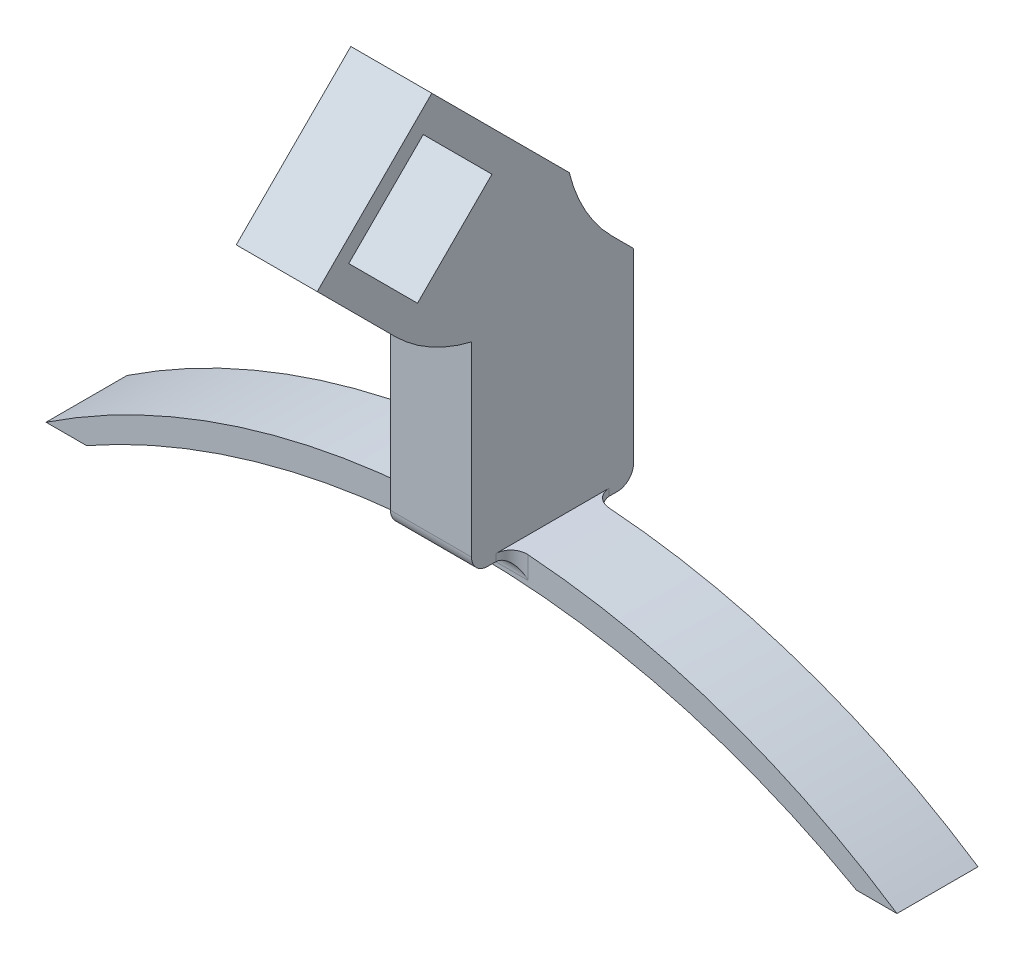
ISO-10303-21;
HEADER;
FILE_DESCRIPTION(('STEP AP214'),'2;1');
FILE_NAME('part.step','',(''),(''),'','','');
FILE_SCHEMA(('AUTOMOTIVE_DESIGN { 1 0 10303 214 1 1 1 1 }'));
ENDSEC;
DATA;
#1=APPLICATION_CONTEXT('core data for automotive mechanical design processes');
#2=APPLICATION_PROTOCOL_DEFINITION('international standard','automotive_design',2000,#1);
#3=PRODUCT_CONTEXT('',#1,'mechanical');
#4=PRODUCT('Part','Part','',(#3));
#5=PRODUCT_RELATED_PRODUCT_CATEGORY('part','',(#4));
#6=PRODUCT_DEFINITION_FORMATION('','',#4);
#7=PRODUCT_DEFINITION_CONTEXT('part definition',#1,'design');
#8=PRODUCT_DEFINITION('design','',#6,#7);
#9=PRODUCT_DEFINITION_SHAPE('','',#8);
#10=(LENGTH_UNIT() NAMED_UNIT(*) SI_UNIT(.MILLI.,.METRE.));
#11=(NAMED_UNIT(*) PLANE_ANGLE_UNIT() SI_UNIT($,.RADIAN.));
#12=(NAMED_UNIT(*) SI_UNIT($,.STERADIAN.) SOLID_ANGLE_UNIT());
#13=UNCERTAINTY_MEASURE_WITH_UNIT(LENGTH_MEASURE(1.E-05),#10,'distance_accuracy_value','');
#14=(GEOMETRIC_REPRESENTATION_CONTEXT(3) GLOBAL_UNCERTAINTY_ASSIGNED_CONTEXT((#13)) GLOBAL_UNIT_ASSIGNED_CONTEXT((#10,
#11,#12)) REPRESENTATION_CONTEXT('',''));
#15=CARTESIAN_POINT('',(0.,0.,0.));
#16=DIRECTION('',(0.,0.,1.));
#17=DIRECTION('',(1.,0.,0.));
#18=AXIS2_PLACEMENT_3D('',#15,#16,#17);
#19=CARTESIAN_POINT('',(52.5285613540198,-34.7033219348849,7.5));
#20=DIRECTION('',(0.,0.,-1.));
#21=DIRECTION('',(-1.,0.,0.));
#22=AXIS2_PLACEMENT_3D('',#19,#20,#21);
#23=CYLINDRICAL_SURFACE('',#22,47.4894594322548);
#24=DIRECTION('',(0.,0.,-1.));
#25=VECTOR('',#24,1.);
#26=CARTESIAN_POINT('',(50.0285613540198,12.7202877671167,7.5));
#27=LINE('',#26,#25);
#28=CARTESIAN_POINT('',(50.0285613540198,12.7202877671167,1.5));
#29=VERTEX_POINT('',#28);
#30=CARTESIAN_POINT('',(50.0285613540198,12.7202877671167,8.5));
#31=VERTEX_POINT('',#30);
#32=EDGE_CURVE('E355',#29,#31,#27,.F.);
#33=ORIENTED_EDGE('',*,*,#32,.F.);
#34=CARTESIAN_POINT('',(50.0285613540198,12.7202877671167,1.5));
#35=CARTESIAN_POINT('',(50.0285611870085,12.7202876143016,1.5281028969218));
#36=CARTESIAN_POINT('',(50.027375949356,12.7202252930694,1.55619232424922));
#37=CARTESIAN_POINT('',(50.0226476887969,12.7199757376473,1.61217003102266));
#38=CARTESIAN_POINT('',(50.0191047831366,12.7197885096689,1.64005832040151));
#39=CARTESIAN_POINT('',(50.0049737469269,12.7190394313109,1.72307141389749));
#40=CARTESIAN_POINT('',(49.9908832008338,12.7182901891765,1.77763992577612));
#41=CARTESIAN_POINT('',(49.953756408002,12.7162887570188,1.88363154197802));
#42=CARTESIAN_POINT('',(49.9307159429681,12.7150363298236,1.93505314984708));
#43=CARTESIAN_POINT('',(49.8763508538252,12.7120265805486,2.03329373375107));
#44=CARTESIAN_POINT('',(49.8450276293138,12.7102693437658,2.08011348556314));
#45=CARTESIAN_POINT('',(49.7749761442007,12.7062525549617,2.16784595949825));
#46=CARTESIAN_POINT('',(49.7362446344536,12.703992782466,2.20875607588789));
#47=CARTESIAN_POINT('',(49.6524815534041,12.6989847453834,2.28350133233952));
#48=CARTESIAN_POINT('',(49.6074487674595,12.6962363865883,2.31733510521193));
#49=CARTESIAN_POINT('',(49.5123057312809,12.6902771307497,2.37701246497592));
#50=CARTESIAN_POINT('',(49.462187881212,12.6870655382727,2.4028438513297));
#51=CARTESIAN_POINT('',(49.3583629745673,12.6802332144889,2.44571706659243));
#52=CARTESIAN_POINT('',(49.3046578903845,12.676612707274,2.46276368147772));
#53=CARTESIAN_POINT('',(49.2136236116243,12.6703128597763,2.48343392968768));
#54=CARTESIAN_POINT('',(49.1768539704628,12.6677259345879,2.48964306664276));
#55=CARTESIAN_POINT('',(49.1029138539176,12.6624366090674,2.49792558620556));
#56=CARTESIAN_POINT('',(49.0657440302243,12.6597343799575,2.50000489714784));
#57=CARTESIAN_POINT('',(49.0285613540198,12.6569858889435,2.5));
#58=B_SPLINE_CURVE_WITH_KNOTS('',3,(#34,#35,#36,#37,#38,#39,#40,#41,#42,#43,#44,#45,#46,#47,#48,
#49,#50,#51,#52,#53,#54,#55,#56,#57),.UNSPECIFIED.,.F.,.F.,(4,2,2,2,2,2,2,2,2,2,2,4),(0.,
0.0842568840678303,0.168509578373974,0.336732167263269,0.505034139578706,0.673307690846444,
0.841655213903606,1.01003523266943,1.17867071647206,1.3472142296471,1.45913769869857,
1.57090038598479),.UNSPECIFIED.);
#59=CARTESIAN_POINT('',(49.0285613540198,12.6569858889435,2.5));
#60=VERTEX_POINT('',#59);
#61=EDGE_CURVE('E52',#29,#60,#58,.T.);
#62=ORIENTED_EDGE('',*,*,#61,.T.);
#63=CARTESIAN_POINT('',(52.5285613540198,-34.7033219348849,2.5));
#64=DIRECTION('',(0.,0.,1.));
#65=DIRECTION('',(-1.,0.,0.));
#66=AXIS2_PLACEMENT_3D('',#63,#64,#65);
#67=CIRCLE('',#66,47.4894594322548);
#68=CARTESIAN_POINT('',(26.2642806770099,4.86227319127271,2.5));
#69=VERTEX_POINT('',#68);
#70=EDGE_CURVE('E358',#60,#69,#67,.T.);
#71=ORIENTED_EDGE('',*,*,#70,.T.);
#72=DIRECTION('',(0.,0.,-1.));
#73=VECTOR('',#72,1.);
#74=CARTESIAN_POINT('',(26.2642806770099,4.86227319127271,7.5));
#75=LINE('',#74,#73);
#76=CARTESIAN_POINT('',(26.2642806770099,4.86227319127271,7.5));
#77=VERTEX_POINT('',#76);
#78=EDGE_CURVE('E398',#77,#69,#75,.T.);
#79=ORIENTED_EDGE('',*,*,#78,.F.);
#80=CARTESIAN_POINT('',(52.5285613540198,-34.7033219348849,7.5));
#81=DIRECTION('',(0.,0.,1.));
#82=DIRECTION('',(-1.,0.,0.));
#83=AXIS2_PLACEMENT_3D('',#80,#81,#82);
#84=CIRCLE('',#83,47.4894594322548);
#85=CARTESIAN_POINT('',(49.0285613540198,12.6569858889435,7.5));
#86=VERTEX_POINT('',#85);
#87=EDGE_CURVE('E364',#86,#77,#84,.T.);
#88=ORIENTED_EDGE('',*,*,#87,.F.);
#89=CARTESIAN_POINT('',(49.0285613540198,12.6569858889435,7.5));
#90=CARTESIAN_POINT('',(49.0567202498051,12.659067015759,7.50000022499935));
#91=CARTESIAN_POINT('',(49.0848676233445,12.661121726342,7.50119013401365));
#92=CARTESIAN_POINT('',(49.1409654302538,12.6651669581399,7.50593836505136));
#93=CARTESIAN_POINT('',(49.1689158708592,12.6671574817227,7.50949659959752));
#94=CARTESIAN_POINT('',(49.2521274047336,12.6730098689455,7.52369270268104));
#95=CARTESIAN_POINT('',(49.3068377033602,12.6767591166834,7.53785205098455));
#96=CARTESIAN_POINT('',(49.4131223690788,12.6838666714362,7.57518037273886));
#97=CARTESIAN_POINT('',(49.4646950460863,12.6872247686325,7.59835415299989));
#98=CARTESIAN_POINT('',(49.5632242368278,12.6934919892054,7.65305955768381));
#99=CARTESIAN_POINT('',(49.6101817105833,12.696401206027,7.68458943886511));
#100=CARTESIAN_POINT('',(49.6980629456667,12.7017302775936,7.75505999913046));
#101=CARTESIAN_POINT('',(49.7389964339797,12.70415092364,7.79398849338239));
#102=CARTESIAN_POINT('',(49.8137570856107,12.7084909479955,7.87819808773634));
#103=CARTESIAN_POINT('',(49.8475828592652,12.7104102282981,7.92348042722829));
#104=CARTESIAN_POINT('',(49.9070927232626,12.7137377532242,8.01901579378939));
#105=CARTESIAN_POINT('',(49.9327904944188,12.7151468571464,8.06926027958997));
#106=CARTESIAN_POINT('',(49.9753753723525,12.7174589125023,8.17334997303155));
#107=CARTESIAN_POINT('',(49.992267822675,12.7183621709353,8.22719297446141));
#108=CARTESIAN_POINT('',(50.0125093649755,12.7194395112318,8.31781146466466));
#109=CARTESIAN_POINT('',(50.0185252639185,12.7197579280393,8.35401197423569));
#110=CARTESIAN_POINT('',(50.0265506670198,12.7201817773474,8.42680321401513));
#111=CARTESIAN_POINT('',(50.0285658755739,12.7202875131029,8.46339331372184));
#112=CARTESIAN_POINT('',(50.0285613540198,12.7202877671167,8.5));
#113=B_SPLINE_CURVE_WITH_KNOTS('',3,(#89,#90,#91,#92,#93,#94,#95,#96,#97,#98,#99,#100,#101,#102,
#103,#104,#105,#106,#107,#108,#109,#110,#111,#112),.UNSPECIFIED.,.F.,.F.,(4,2,2,2,2,2,2,2,2,2,2,
4),(0.,0.0846552642189612,0.169307401756448,0.338347371899864,0.507477603899872,
0.676572579853326,0.845391448044261,1.01424329217599,1.18280939852037,1.35127309038726,
1.46116205514336,1.57089422154783),.UNSPECIFIED.);
#114=EDGE_CURVE('E486',#86,#31,#113,.T.);
#115=ORIENTED_EDGE('',*,*,#114,.T.);
#116=EDGE_LOOP('',(#33,#62,#71,#79,#88,#115));
#117=FACE_BOUND('',#116,.T.);
#118=ADVANCED_FACE('F41',(#117),#23,.T.);
#119=DIRECTION('',(0.,0.,-1.));
#120=VECTOR('',#119,1.);
#121=CARTESIAN_POINT('',(55.0285613540198,12.7202877671167,7.5));
#122=LINE('',#121,#120);
#123=CARTESIAN_POINT('',(55.0285613540198,12.7202877671167,8.5));
#124=VERTEX_POINT('',#123);
#125=CARTESIAN_POINT('',(55.0285613540198,12.7202877671167,1.5));
#126=VERTEX_POINT('',#125);
#127=EDGE_CURVE('E352',#124,#126,#122,.T.);
#128=ORIENTED_EDGE('',*,*,#127,.F.);
#129=CARTESIAN_POINT('',(55.0285613540198,12.7202877671167,8.5));
#130=CARTESIAN_POINT('',(55.0285615210311,12.7202876143016,8.4718971030782));
#131=CARTESIAN_POINT('',(55.0297467586836,12.7202252930694,8.44380767575078));
#132=CARTESIAN_POINT('',(55.0344750192426,12.7199757376473,8.38782996897734));
#133=CARTESIAN_POINT('',(55.0380179249029,12.7197885096689,8.35994167959849));
#134=CARTESIAN_POINT('',(55.0521489611127,12.7190394313109,8.27692858610251));
#135=CARTESIAN_POINT('',(55.0662395072057,12.7182901891765,8.22236007422388));
#136=CARTESIAN_POINT('',(55.1033663000376,12.7162887570188,8.11636845802198));
#137=CARTESIAN_POINT('',(55.1264067650715,12.7150363298236,8.06494685015292));
#138=CARTESIAN_POINT('',(55.1807718542144,12.7120265805486,7.96670626624893));
#139=CARTESIAN_POINT('',(55.2120950787257,12.7102693437658,7.91988651443686));
#140=CARTESIAN_POINT('',(55.2821465638388,12.7062525549617,7.83215404050175));
#141=CARTESIAN_POINT('',(55.320878073586,12.703992782466,7.79124392411211));
#142=CARTESIAN_POINT('',(55.4046411546354,12.6989847453834,7.71649866766047));
#143=CARTESIAN_POINT('',(55.4496739405801,12.6962363865883,7.68266489478807));
#144=CARTESIAN_POINT('',(55.5448169767587,12.6902771307497,7.62298753502409));
#145=CARTESIAN_POINT('',(55.5949348268276,12.6870655382727,7.5971561486703));
#146=CARTESIAN_POINT('',(55.6987597334723,12.6802332144889,7.55428293340757));
#147=CARTESIAN_POINT('',(55.7524648176551,12.676612707274,7.53723631852228));
#148=CARTESIAN_POINT('',(55.8434990964153,12.6703128597763,7.51656607031232));
#149=CARTESIAN_POINT('',(55.8802687375767,12.6677259345879,7.51035693335724));
#150=CARTESIAN_POINT('',(55.954208854122,12.6624366090674,7.50207441379444));
#151=CARTESIAN_POINT('',(55.9913786778153,12.6597343799575,7.49999510285216));
#152=CARTESIAN_POINT('',(56.0285613540198,12.6569858889435,7.5));
#153=B_SPLINE_CURVE_WITH_KNOTS('',3,(#129,#130,#131,#132,#133,#134,#135,#136,#137,#138,#139,
#140,#141,#142,#143,#144,#145,#146,#147,#148,#149,#150,#151,#152),.UNSPECIFIED.,.F.,.F.,(4,2,2,
2,2,2,2,2,2,2,2,4),(0.,0.0842568840678318,0.168509578373973,0.336732167263268,0.50503413957871,
0.673307690846443,0.841655213903608,1.01003523266943,1.17867071647206,1.3472142296471,
1.45913769869856,1.57090038598479),.UNSPECIFIED.);
#154=CARTESIAN_POINT('',(56.0285613540198,12.6569858889435,7.5));
#155=VERTEX_POINT('',#154);
#156=EDGE_CURVE('E496',#124,#155,#153,.T.);
#157=ORIENTED_EDGE('',*,*,#156,.T.);
#158=CARTESIAN_POINT('',(78.7928420310297,4.86227319127271,7.5));
#159=VERTEX_POINT('',#158);
#160=EDGE_CURVE('E359',#159,#155,#84,.T.);
#161=ORIENTED_EDGE('',*,*,#160,.F.);
#162=DIRECTION('',(0.,0.,-1.));
#163=VECTOR('',#162,1.);
#164=CARTESIAN_POINT('',(78.7928420310297,4.86227319127271,7.5));
#165=LINE('',#164,#163);
#166=CARTESIAN_POINT('',(78.7928420310297,4.86227319127271,2.5));
#167=VERTEX_POINT('',#166);
#168=EDGE_CURVE('E373',#159,#167,#165,.T.);
#169=ORIENTED_EDGE('',*,*,#168,.T.);
#170=CARTESIAN_POINT('',(56.0285613540198,12.6569858889435,2.5));
#171=VERTEX_POINT('',#170);
#172=EDGE_CURVE('E374',#167,#171,#67,.T.);
#173=ORIENTED_EDGE('',*,*,#172,.T.);
#174=CARTESIAN_POINT('',(56.0285613540198,12.6569858889435,2.5));
#175=CARTESIAN_POINT('',(56.0004024582345,12.659067015759,2.49999977500065));
#176=CARTESIAN_POINT('',(55.9722550846951,12.661121726342,2.49880986598635));
#177=CARTESIAN_POINT('',(55.9161572777858,12.6651669581399,2.49406163494864));
#178=CARTESIAN_POINT('',(55.8882068371804,12.6671574817227,2.49050340040248));
#179=CARTESIAN_POINT('',(55.8049953033059,12.6730098689455,2.47630729731897));
#180=CARTESIAN_POINT('',(55.7502850046794,12.6767591166834,2.46214794901546));
#181=CARTESIAN_POINT('',(55.6440003389607,12.6838666714362,2.42481962726114));
#182=CARTESIAN_POINT('',(55.5924276619533,12.6872247686325,2.40164584700011));
#183=CARTESIAN_POINT('',(55.4938984712118,12.6934919892054,2.34694044231619));
#184=CARTESIAN_POINT('',(55.4469409974562,12.696401206027,2.31541056113489));
#185=CARTESIAN_POINT('',(55.3590597623729,12.7017302775936,2.24494000086954));
#186=CARTESIAN_POINT('',(55.3181262740599,12.70415092364,2.20601150661761));
#187=CARTESIAN_POINT('',(55.2433656224288,12.7084909479955,2.12180191226366));
#188=CARTESIAN_POINT('',(55.2095398487743,12.7104102282981,2.07651957277171));
#189=CARTESIAN_POINT('',(55.150029984777,12.7137377532242,1.98098420621061));
#190=CARTESIAN_POINT('',(55.1243322136208,12.7151468571464,1.93073972041003));
#191=CARTESIAN_POINT('',(55.0817473356871,12.7174589125023,1.82665002696845));
#192=CARTESIAN_POINT('',(55.0648548853646,12.7183621709353,1.77280702553859));
#193=CARTESIAN_POINT('',(55.0446133430641,12.7194395112318,1.68218853533534));
#194=CARTESIAN_POINT('',(55.0385974441211,12.7197579280393,1.64598802576431));
#195=CARTESIAN_POINT('',(55.0305720410198,12.7201817773474,1.57319678598487));
#196=CARTESIAN_POINT('',(55.0285568324657,12.7202875131029,1.53660668627816));
#197=CARTESIAN_POINT('',(55.0285613540198,12.7202877671167,1.5));
#198=B_SPLINE_CURVE_WITH_KNOTS('',3,(#174,#175,#176,#177,#178,#179,#180,#181,#182,#183,#184,
#185,#186,#187,#188,#189,#190,#191,#192,#193,#194,#195,#196,#197),.UNSPECIFIED.,.F.,.F.,(4,2,2,
2,2,2,2,2,2,2,2,4),(0.,0.084655264218954,0.169307401756441,0.338347371899864,0.507477603899872,
0.676572579853326,0.845391448044258,1.01424329217599,1.18280939852037,1.35127309038726,
1.46116205514337,1.57089422154783),.UNSPECIFIED.);
#199=EDGE_CURVE('E11',#171,#126,#198,.T.);
#200=ORIENTED_EDGE('',*,*,#199,.T.);
#201=EDGE_LOOP('',(#128,#157,#161,#169,#173,#200));
#202=FACE_BOUND('',#201,.T.);
#203=ADVANCED_FACE('F556',(#202),#23,.T.);
#204=CARTESIAN_POINT('',(52.5285613540198,-34.7033219348849,7.5));
#205=DIRECTION('',(0.,0.,-1.));
#206=DIRECTION('',(-1.,0.,0.));
#207=AXIS2_PLACEMENT_3D('',#204,#205,#206);
#208=PLANE('',#207);
#209=DIRECTION('',(-1.,0.,0.));
#210=VECTOR('',#209,1.);
#211=CARTESIAN_POINT('',(52.5285613540198,11.28613749737,7.5));
#212=LINE('',#211,#210);
#213=CARTESIAN_POINT('',(56.0285613540198,11.28613749737,7.5));
#214=VERTEX_POINT('',#213);
#215=CARTESIAN_POINT('',(49.0285613540198,11.28613749737,7.5));
#216=VERTEX_POINT('',#215);
#217=EDGE_CURVE('E469',#214,#216,#212,.T.);
#218=ORIENTED_EDGE('',*,*,#217,.T.);
#219=DIRECTION('',(0.,-1.,0.));
#220=VECTOR('',#219,1.);
#221=CARTESIAN_POINT('',(49.0285613540198,12.7202877671167,7.5));
#222=LINE('',#221,#220);
#223=EDGE_CURVE('E475',#216,#86,#222,.F.);
#224=ORIENTED_EDGE('',*,*,#223,.T.);
#225=ORIENTED_EDGE('',*,*,#87,.T.);
#226=DIRECTION('',(1.,0.,0.));
#227=VECTOR('',#226,1.);
#228=CARTESIAN_POINT('',(26.2642806770099,4.86227319127271,7.5));
#229=LINE('',#228,#227);
#230=CARTESIAN_POINT('',(28.7642806770099,4.86227319127271,7.5));
#231=VERTEX_POINT('',#230);
#232=EDGE_CURVE('E363',#77,#231,#229,.T.);
#233=ORIENTED_EDGE('',*,*,#232,.T.);
#234=CARTESIAN_POINT('',(52.5285613540198,-37.3721684334914,7.5));
#235=DIRECTION('',(0.,0.,-1.));
#236=DIRECTION('',(-1.,0.,0.));
#237=AXIS2_PLACEMENT_3D('',#234,#235,#236);
#238=CIRCLE('',#237,48.4612122779786);
#239=CARTESIAN_POINT('',(76.2928420310297,4.8622731912727,7.5));
#240=VERTEX_POINT('',#239);
#241=EDGE_CURVE('E367',#231,#240,#238,.T.);
#242=ORIENTED_EDGE('',*,*,#241,.T.);
#243=DIRECTION('',(1.,0.,0.));
#244=VECTOR('',#243,1.);
#245=CARTESIAN_POINT('',(78.7928420310297,4.86227319127271,7.5));
#246=LINE('',#245,#244);
#247=EDGE_CURVE('E370',#240,#159,#246,.T.);
#248=ORIENTED_EDGE('',*,*,#247,.T.);
#249=ORIENTED_EDGE('',*,*,#160,.T.);
#250=DIRECTION('',(0.,1.,0.));
#251=VECTOR('',#250,1.);
#252=CARTESIAN_POINT('',(56.0285613540198,12.28613749737,7.5));
#253=LINE('',#252,#251);
#254=EDGE_CURVE('E472',#155,#214,#253,.F.);
#255=ORIENTED_EDGE('',*,*,#254,.T.);
#256=EDGE_LOOP('',(#218,#224,#225,#233,#242,#248,#249,#255));
#257=FACE_BOUND('',#256,.T.);
#258=ADVANCED_FACE('F644',(#257),#208,.F.);
#259=CARTESIAN_POINT('',(52.5285613540198,-34.7033219348849,2.5));
#260=DIRECTION('',(0.,0.,-1.));
#261=DIRECTION('',(-1.,0.,0.));
#262=AXIS2_PLACEMENT_3D('',#259,#260,#261);
#263=PLANE('',#262);
#264=ORIENTED_EDGE('',*,*,#70,.F.);
#265=DIRECTION('',(0.,-1.,0.));
#266=VECTOR('',#265,1.);
#267=CARTESIAN_POINT('',(49.0285613540198,-34.7033219348849,2.5));
#268=LINE('',#267,#266);
#269=CARTESIAN_POINT('',(49.0285613540198,11.28613749737,2.5));
#270=VERTEX_POINT('',#269);
#271=EDGE_CURVE('E483',#60,#270,#268,.T.);
#272=ORIENTED_EDGE('',*,*,#271,.T.);
#273=DIRECTION('',(-1.,0.,0.));
#274=VECTOR('',#273,1.);
#275=CARTESIAN_POINT('',(55.0285613540198,11.28613749737,2.5));
#276=LINE('',#275,#274);
#277=CARTESIAN_POINT('',(56.0285613540198,11.28613749737,2.5));
#278=VERTEX_POINT('',#277);
#279=EDGE_CURVE('E60',#270,#278,#276,.F.);
#280=ORIENTED_EDGE('',*,*,#279,.T.);
#281=DIRECTION('',(0.,1.,0.));
#282=VECTOR('',#281,1.);
#283=CARTESIAN_POINT('',(56.0285613540198,-34.7033219348849,2.5));
#284=LINE('',#283,#282);
#285=EDGE_CURVE('E480',#278,#171,#284,.T.);
#286=ORIENTED_EDGE('',*,*,#285,.T.);
#287=ORIENTED_EDGE('',*,*,#172,.F.);
#288=DIRECTION('',(1.,0.,0.));
#289=VECTOR('',#288,1.);
#290=CARTESIAN_POINT('',(78.7928420310297,4.86227319127271,2.5));
#291=LINE('',#290,#289);
#292=CARTESIAN_POINT('',(76.2928420310297,4.8622731912727,2.5));
#293=VERTEX_POINT('',#292);
#294=EDGE_CURVE('E384',#293,#167,#291,.T.);
#295=ORIENTED_EDGE('',*,*,#294,.F.);
#296=CARTESIAN_POINT('',(52.5285613540198,-37.3721684334914,2.5));
#297=DIRECTION('',(0.,0.,-1.));
#298=DIRECTION('',(-1.,0.,0.));
#299=AXIS2_PLACEMENT_3D('',#296,#297,#298);
#300=CIRCLE('',#299,48.4612122779786);
#301=CARTESIAN_POINT('',(28.7642806770099,4.86227319127271,2.5));
#302=VERTEX_POINT('',#301);
#303=EDGE_CURVE('E381',#302,#293,#300,.T.);
#304=ORIENTED_EDGE('',*,*,#303,.F.);
#305=DIRECTION('',(1.,0.,0.));
#306=VECTOR('',#305,1.);
#307=CARTESIAN_POINT('',(26.2642806770099,4.86227319127271,2.5));
#308=LINE('',#307,#306);
#309=EDGE_CURVE('E378',#69,#302,#308,.T.);
#310=ORIENTED_EDGE('',*,*,#309,.F.);
#311=EDGE_LOOP('',(#264,#272,#280,#286,#287,#295,#304,#310));
#312=FACE_BOUND('',#311,.T.);
#313=ADVANCED_FACE('F553',(#312),#263,.T.);
#314=CARTESIAN_POINT('',(26.2642806770099,4.86227319127271,7.5));
#315=DIRECTION('',(0.,1.,0.));
#316=DIRECTION('',(0.,0.,1.));
#317=AXIS2_PLACEMENT_3D('',#314,#315,#316);
#318=PLANE('',#317);
#319=ORIENTED_EDGE('',*,*,#309,.T.);
#320=DIRECTION('',(0.,0.,-1.));
#321=VECTOR('',#320,1.);
#322=CARTESIAN_POINT('',(28.7642806770099,4.86227319127271,7.5));
#323=LINE('',#322,#321);
#324=EDGE_CURVE('E394',#231,#302,#323,.T.);
#325=ORIENTED_EDGE('',*,*,#324,.F.);
#326=ORIENTED_EDGE('',*,*,#232,.F.);
#327=ORIENTED_EDGE('',*,*,#78,.T.);
#328=EDGE_LOOP('',(#319,#325,#326,#327));
#329=FACE_BOUND('',#328,.T.);
#330=ADVANCED_FACE('F571',(#329),#318,.F.);
#331=CARTESIAN_POINT('',(52.5285613540198,-37.3721684334914,7.5));
#332=DIRECTION('',(0.,0.,-1.));
#333=DIRECTION('',(-1.,0.,0.));
#334=AXIS2_PLACEMENT_3D('',#331,#332,#333);
#335=CYLINDRICAL_SURFACE('',#334,48.4612122779786);
#336=ORIENTED_EDGE('',*,*,#303,.T.);
#337=DIRECTION('',(0.,0.,-1.));
#338=VECTOR('',#337,1.);
#339=CARTESIAN_POINT('',(76.2928420310297,4.8622731912727,7.5));
#340=LINE('',#339,#338);
#341=EDGE_CURVE('E390',#240,#293,#340,.T.);
#342=ORIENTED_EDGE('',*,*,#341,.F.);
#343=ORIENTED_EDGE('',*,*,#241,.F.);
#344=ORIENTED_EDGE('',*,*,#324,.T.);
#345=EDGE_LOOP('',(#336,#342,#343,#344));
#346=FACE_BOUND('',#345,.T.);
#347=ADVANCED_FACE('F566',(#346),#335,.F.);
#348=CARTESIAN_POINT('',(78.7928420310297,4.86227319127271,7.5));
#349=DIRECTION('',(0.,1.,0.));
#350=DIRECTION('',(-1.,0.,0.));
#351=AXIS2_PLACEMENT_3D('',#348,#349,#350);
#352=PLANE('',#351);
#353=ORIENTED_EDGE('',*,*,#294,.T.);
#354=ORIENTED_EDGE('',*,*,#168,.F.);
#355=ORIENTED_EDGE('',*,*,#247,.F.);
#356=ORIENTED_EDGE('',*,*,#341,.T.);
#357=EDGE_LOOP('',(#353,#354,#355,#356));
#358=FACE_BOUND('',#357,.T.);
#359=ADVANCED_FACE('F561',(#358),#352,.F.);
#360=CARTESIAN_POINT('',(50.0285613540198,12.28613749737,9.99999999999999));
#361=DIRECTION('',(1.,0.,0.));
#362=DIRECTION('',(0.,0.,-1.));
#363=AXIS2_PLACEMENT_3D('',#360,#361,#362);
#364=PLANE('',#363);
#365=DIRECTION('',(0.,-0.707106781186548,-0.707106781186548));
#366=VECTOR('',#365,1.);
#367=CARTESIAN_POINT('',(50.0285613540198,23.3342345362263,-1.04809703885629));
#368=LINE('',#367,#366);
#369=CARTESIAN_POINT('',(50.0285613540198,37.3624091292783,12.9800775541957));
#370=VERTEX_POINT('',#369);
#371=CARTESIAN_POINT('',(50.0285613540198,33.119768442159,8.73743686707646));
#372=VERTEX_POINT('',#371);
#373=EDGE_CURVE('E273',#370,#372,#368,.T.);
#374=ORIENTED_EDGE('',*,*,#373,.F.);
#375=DIRECTION('',(0.,-0.707106781186547,0.707106781186548));
#376=VECTOR('',#375,1.);
#377=CARTESIAN_POINT('',(50.0285613540198,26.314312090422,24.028174593052));
#378=LINE('',#377,#376);
#379=CARTESIAN_POINT('',(50.0285613540198,32.7662150515657,17.5762716319083));
#380=VERTEX_POINT('',#379);
#381=EDGE_CURVE('E276',#370,#380,#378,.T.);
#382=ORIENTED_EDGE('',*,*,#381,.T.);
#383=DIRECTION('',(0.,-0.707106781186548,-0.707106781186548));
#384=VECTOR('',#383,1.);
#385=CARTESIAN_POINT('',(50.0285613540198,18.7380404585137,3.54809703885627));
#386=LINE('',#385,#384);
#387=CARTESIAN_POINT('',(50.0285613540198,28.5235743644465,13.333630944789));
#388=VERTEX_POINT('',#387);
#389=EDGE_CURVE('E264',#380,#388,#386,.T.);
#390=ORIENTED_EDGE('',*,*,#389,.T.);
#391=DIRECTION('',(0.,-0.707106781186547,0.707106781186548));
#392=VECTOR('',#391,1.);
#393=CARTESIAN_POINT('',(50.0285613540198,22.0716714033027,19.7855339059327));
#394=LINE('',#393,#392);
#395=EDGE_CURVE('E234',#372,#388,#394,.T.);
#396=ORIENTED_EDGE('',*,*,#395,.F.);
#397=EDGE_LOOP('',(#374,#382,#390,#396));
#398=FACE_BOUND('',#397,.T.);
#399=DIRECTION('',(0.,1.,0.));
#400=VECTOR('',#399,1.);
#401=CARTESIAN_POINT('',(50.0285613540198,12.28613749737,0.));
#402=LINE('',#401,#400);
#403=CARTESIAN_POINT('',(50.0285613540198,13.28613749737,0.));
#404=VERTEX_POINT('',#403);
#405=CARTESIAN_POINT('',(50.0285613540198,24.78613749737,0.));
#406=VERTEX_POINT('',#405);
#407=EDGE_CURVE('E349',#404,#406,#402,.T.);
#408=ORIENTED_EDGE('',*,*,#407,.F.);
#409=CARTESIAN_POINT('',(50.0285613540198,13.28613749737,1.));
#410=DIRECTION('',(1.,0.,0.));
#411=DIRECTION('',(0.,0.,-1.));
#412=AXIS2_PLACEMENT_3D('',#409,#410,#411);
#413=CIRCLE('',#412,1.);
#414=CARTESIAN_POINT('',(50.0285613540198,12.28613749737,1.));
#415=VERTEX_POINT('',#414);
#416=EDGE_CURVE('E456',#404,#415,#413,.F.);
#417=ORIENTED_EDGE('',*,*,#416,.T.);
#418=DIRECTION('',(0.,0.,-1.));
#419=VECTOR('',#418,1.);
#420=CARTESIAN_POINT('',(50.0285613540198,12.28613749737,9.99999999999999));
#421=LINE('',#420,#419);
#422=CARTESIAN_POINT('',(50.0285613540198,12.28613749737,1.5));
#423=VERTEX_POINT('',#422);
#424=EDGE_CURVE('E330',#423,#415,#421,.T.);
#425=ORIENTED_EDGE('',*,*,#424,.F.);
#426=DIRECTION('',(0.,-1.,0.));
#427=VECTOR('',#426,1.);
#428=CARTESIAN_POINT('',(50.0285613540198,12.28613749737,1.5));
#429=LINE('',#428,#427);
#430=EDGE_CURVE('E445',#423,#29,#429,.F.);
#431=ORIENTED_EDGE('',*,*,#430,.T.);
#432=ORIENTED_EDGE('',*,*,#32,.T.);
#433=DIRECTION('',(0.,-1.,0.));
#434=VECTOR('',#433,1.);
#435=CARTESIAN_POINT('',(50.0285613540198,12.28613749737,8.5));
#436=LINE('',#435,#434);
#437=CARTESIAN_POINT('',(50.0285613540198,12.28613749737,8.5));
#438=VERTEX_POINT('',#437);
#439=EDGE_CURVE('E449',#31,#438,#436,.T.);
#440=ORIENTED_EDGE('',*,*,#439,.T.);
#441=CARTESIAN_POINT('',(50.0285613540198,12.28613749737,8.99999999999999));
#442=VERTEX_POINT('',#441);
#443=EDGE_CURVE('E331',#442,#438,#421,.T.);
#444=ORIENTED_EDGE('',*,*,#443,.F.);
#445=CARTESIAN_POINT('',(50.0285613540198,13.28613749737,8.99999999999999));
#446=DIRECTION('',(1.,0.,0.));
#447=DIRECTION('',(0.,0.,-1.));
#448=AXIS2_PLACEMENT_3D('',#445,#446,#447);
#449=CIRCLE('',#448,1.);
#450=CARTESIAN_POINT('',(50.0285613540198,13.28613749737,9.99999999999999));
#451=VERTEX_POINT('',#450);
#452=EDGE_CURVE('E453',#442,#451,#449,.F.);
#453=ORIENTED_EDGE('',*,*,#452,.T.);
#454=DIRECTION('',(0.,1.,0.));
#455=VECTOR('',#454,1.);
#456=CARTESIAN_POINT('',(50.0285613540198,12.28613749737,9.99999999999999));
#457=LINE('',#456,#455);
#458=CARTESIAN_POINT('',(50.0285613540198,24.78613749737,10.));
#459=VERTEX_POINT('',#458);
#460=EDGE_CURVE('E340',#451,#459,#457,.T.);
#461=ORIENTED_EDGE('',*,*,#460,.T.);
#462=CARTESIAN_POINT('',(50.0285613540198,34.5057357988225,7.64853048958703));
#463=DIRECTION('',(1.,0.,0.));
#464=DIRECTION('',(0.,0.,-1.));
#465=AXIS2_PLACEMENT_3D('',#462,#463,#464);
#466=CIRCLE('',#465,10.);
#467=CARTESIAN_POINT('',(50.0285613540198,27.434667986957,14.7195983014525));
#468=VERTEX_POINT('',#467);
#469=EDGE_CURVE('E410',#459,#468,#466,.F.);
#470=ORIENTED_EDGE('',*,*,#469,.T.);
#471=DIRECTION('',(0.,-0.707106781186546,-0.707106781186548));
#472=VECTOR('',#471,1.);
#473=CARTESIAN_POINT('',(50.0285613540198,32.2358849656758,19.5208152801713));
#474=LINE('',#473,#472);
#475=CARTESIAN_POINT('',(50.0285613540198,32.2358849656758,19.5208152801713));
#476=VERTEX_POINT('',#475);
#477=EDGE_CURVE('E302',#476,#468,#474,.T.);
#478=ORIENTED_EDGE('',*,*,#477,.F.);
#479=DIRECTION('',(0.,-0.707106781186549,0.707106781186546));
#480=VECTOR('',#479,1.);
#481=CARTESIAN_POINT('',(50.0285613540198,25.8783501229235,25.8783501229236));
#482=LINE('',#481,#480);
#483=CARTESIAN_POINT('',(50.0285613540198,39.3069527775413,12.4497474683059));
#484=VERTEX_POINT('',#483);
#485=EDGE_CURVE('E289',#484,#476,#482,.T.);
#486=ORIENTED_EDGE('',*,*,#485,.F.);
#487=DIRECTION('',(0.,-0.707106781186546,-0.707106781186548));
#488=VECTOR('',#487,1.);
#489=CARTESIAN_POINT('',(50.0285613540198,39.3069527775413,12.4497474683059));
#490=LINE('',#489,#488);
#491=CARTESIAN_POINT('',(50.0285613540198,30.8216714033027,3.96446609406727));
#492=VERTEX_POINT('',#491);
#493=EDGE_CURVE('E306',#484,#492,#490,.T.);
#494=ORIENTED_EDGE('',*,*,#493,.T.);
#495=CARTESIAN_POINT('',(50.0285613540198,33.1731409137157,-5.75513220738522));
#496=DIRECTION('',(1.,0.,0.));
#497=DIRECTION('',(0.,0.,-1.));
#498=AXIS2_PLACEMENT_3D('',#495,#496,#497);
#499=CIRCLE('',#498,10.);
#500=CARTESIAN_POINT('',(50.0285613540198,26.1020731018502,1.31593560448025));
#501=VERTEX_POINT('',#500);
#502=EDGE_CURVE('E416',#492,#501,#499,.T.);
#503=ORIENTED_EDGE('',*,*,#502,.T.);
#504=DIRECTION('',(0.,0.707106781186546,0.707106781186549));
#505=VECTOR('',#504,1.);
#506=CARTESIAN_POINT('',(50.0285613540198,19.8941482999688,-4.89198919740117));
#507=LINE('',#506,#505);
#508=EDGE_CURVE('E315',#406,#501,#507,.T.);
#509=ORIENTED_EDGE('',*,*,#508,.F.);
#510=EDGE_LOOP('',(#408,#417,#425,#431,#432,#440,#444,#453,#461,#470,#478,#486,#494,#503,#509));
#511=FACE_BOUND('',#510,.T.);
#512=ADVANCED_FACE('F641',(#398,#511),#364,.F.);
#513=CARTESIAN_POINT('',(55.0285613540198,12.28613749737,0.));
#514=DIRECTION('',(-1.,0.,0.));
#515=DIRECTION('',(0.,0.,1.));
#516=AXIS2_PLACEMENT_3D('',#513,#514,#515);
#517=PLANE('',#516);
#518=DIRECTION('',(0.,-0.707106781186548,-0.707106781186548));
#519=VECTOR('',#518,1.);
#520=CARTESIAN_POINT('',(55.0285613540198,7.59497170982872,-7.59497170982872));
#521=LINE('',#520,#519);
#522=CARTESIAN_POINT('',(55.0285613540198,32.7662150515657,17.5762716319083));
#523=VERTEX_POINT('',#522);
#524=CARTESIAN_POINT('',(55.0285613540198,28.5235743644465,13.333630944789));
#525=VERTEX_POINT('',#524);
#526=EDGE_CURVE('E243',#523,#525,#521,.T.);
#527=ORIENTED_EDGE('',*,*,#526,.F.);
#528=DIRECTION('',(0.,-0.707106781186547,0.707106781186548));
#529=VECTOR('',#528,1.);
#530=CARTESIAN_POINT('',(55.0285613540198,25.171243341737,25.171243341737));
#531=LINE('',#530,#529);
#532=CARTESIAN_POINT('',(55.0285613540198,37.3624091292783,12.9800775541957));
#533=VERTEX_POINT('',#532);
#534=EDGE_CURVE('E249',#533,#523,#531,.T.);
#535=ORIENTED_EDGE('',*,*,#534,.F.);
#536=DIRECTION('',(0.,-0.707106781186548,-0.707106781186548));
#537=VECTOR('',#536,1.);
#538=CARTESIAN_POINT('',(55.0285613540198,12.1911657875413,-12.1911657875413));
#539=LINE('',#538,#537);
#540=CARTESIAN_POINT('',(55.0285613540198,33.119768442159,8.73743686707646));
#541=VERTEX_POINT('',#540);
#542=EDGE_CURVE('E254',#533,#541,#539,.T.);
#543=ORIENTED_EDGE('',*,*,#542,.T.);
#544=DIRECTION('',(0.,-0.707106781186547,0.707106781186548));
#545=VECTOR('',#544,1.);
#546=CARTESIAN_POINT('',(55.0285613540198,20.9286026546177,20.9286026546177));
#547=LINE('',#546,#545);
#548=EDGE_CURVE('E231',#541,#525,#547,.T.);
#549=ORIENTED_EDGE('',*,*,#548,.T.);
#550=EDGE_LOOP('',(#527,#535,#543,#549));
#551=FACE_BOUND('',#550,.T.);
#552=DIRECTION('',(0.,0.,1.));
#553=VECTOR('',#552,1.);
#554=CARTESIAN_POINT('',(55.0285613540198,12.28613749737,0.));
#555=LINE('',#554,#553);
#556=CARTESIAN_POINT('',(55.0285613540198,12.28613749737,1.));
#557=VERTEX_POINT('',#556);
#558=CARTESIAN_POINT('',(55.0285613540198,12.28613749737,1.5));
#559=VERTEX_POINT('',#558);
#560=EDGE_CURVE('E339',#557,#559,#555,.T.);
#561=ORIENTED_EDGE('',*,*,#560,.F.);
#562=CARTESIAN_POINT('',(55.0285613540198,13.28613749737,1.));
#563=DIRECTION('',(-1.,0.,0.));
#564=DIRECTION('',(0.,0.,1.));
#565=AXIS2_PLACEMENT_3D('',#562,#563,#564);
#566=CIRCLE('',#565,1.);
#567=CARTESIAN_POINT('',(55.0285613540198,13.28613749737,0.));
#568=VERTEX_POINT('',#567);
#569=EDGE_CURVE('E439',#557,#568,#566,.F.);
#570=ORIENTED_EDGE('',*,*,#569,.T.);
#571=DIRECTION('',(0.,1.,0.));
#572=VECTOR('',#571,1.);
#573=CARTESIAN_POINT('',(55.0285613540198,12.28613749737,0.));
#574=LINE('',#573,#572);
#575=CARTESIAN_POINT('',(55.0285613540198,24.78613749737,0.));
#576=VERTEX_POINT('',#575);
#577=EDGE_CURVE('E346',#568,#576,#574,.T.);
#578=ORIENTED_EDGE('',*,*,#577,.T.);
#579=DIRECTION('',(0.,0.707106781186546,0.707106781186549));
#580=VECTOR('',#579,1.);
#581=CARTESIAN_POINT('',(55.0285613540198,19.8941482999688,-4.89198919740117));
#582=LINE('',#581,#580);
#583=CARTESIAN_POINT('',(55.0285613540198,26.1020731018502,1.31593560448025));
#584=VERTEX_POINT('',#583);
#585=EDGE_CURVE('E314',#576,#584,#582,.T.);
#586=ORIENTED_EDGE('',*,*,#585,.T.);
#587=CARTESIAN_POINT('',(55.0285613540198,33.1731409137157,-5.75513220738522));
#588=DIRECTION('',(-1.,0.,0.));
#589=DIRECTION('',(0.,0.,1.));
#590=AXIS2_PLACEMENT_3D('',#587,#588,#589);
#591=CIRCLE('',#590,10.);
#592=CARTESIAN_POINT('',(55.0285613540198,30.8216714033027,3.96446609406727));
#593=VERTEX_POINT('',#592);
#594=EDGE_CURVE('E419',#584,#593,#591,.T.);
#595=ORIENTED_EDGE('',*,*,#594,.T.);
#596=DIRECTION('',(0.,-0.707106781186546,-0.707106781186548));
#597=VECTOR('',#596,1.);
#598=CARTESIAN_POINT('',(55.0285613540198,39.3069527775413,12.4497474683059));
#599=LINE('',#598,#597);
#600=CARTESIAN_POINT('',(55.0285613540198,39.3069527775413,12.4497474683059));
#601=VERTEX_POINT('',#600);
#602=EDGE_CURVE('E310',#601,#593,#599,.T.);
#603=ORIENTED_EDGE('',*,*,#602,.F.);
#604=DIRECTION('',(0.,-0.707106781186549,0.707106781186546));
#605=VECTOR('',#604,1.);
#606=CARTESIAN_POINT('',(55.0285613540198,25.8783501229235,25.8783501229236));
#607=LINE('',#606,#605);
#608=CARTESIAN_POINT('',(55.0285613540198,32.2358849656758,19.5208152801713));
#609=VERTEX_POINT('',#608);
#610=EDGE_CURVE('E281',#601,#609,#607,.T.);
#611=ORIENTED_EDGE('',*,*,#610,.T.);
#612=DIRECTION('',(0.,-0.707106781186546,-0.707106781186548));
#613=VECTOR('',#612,1.);
#614=CARTESIAN_POINT('',(55.0285613540198,32.2358849656758,19.5208152801713));
#615=LINE('',#614,#613);
#616=CARTESIAN_POINT('',(55.0285613540198,27.434667986957,14.7195983014525));
#617=VERTEX_POINT('',#616);
#618=EDGE_CURVE('E295',#609,#617,#615,.T.);
#619=ORIENTED_EDGE('',*,*,#618,.T.);
#620=CARTESIAN_POINT('',(55.0285613540198,34.5057357988225,7.64853048958703));
#621=DIRECTION('',(-1.,0.,0.));
#622=DIRECTION('',(0.,0.,1.));
#623=AXIS2_PLACEMENT_3D('',#620,#621,#622);
#624=CIRCLE('',#623,10.);
#625=CARTESIAN_POINT('',(55.0285613540198,24.78613749737,10.));
#626=VERTEX_POINT('',#625);
#627=EDGE_CURVE('E406',#617,#626,#624,.F.);
#628=ORIENTED_EDGE('',*,*,#627,.T.);
#629=DIRECTION('',(0.,1.,0.));
#630=VECTOR('',#629,1.);
#631=CARTESIAN_POINT('',(55.0285613540198,12.28613749737,9.99999999999999));
#632=LINE('',#631,#630);
#633=CARTESIAN_POINT('',(55.0285613540198,13.28613749737,9.99999999999999));
#634=VERTEX_POINT('',#633);
#635=EDGE_CURVE('E343',#634,#626,#632,.T.);
#636=ORIENTED_EDGE('',*,*,#635,.F.);
#637=CARTESIAN_POINT('',(55.0285613540198,13.28613749737,8.99999999999999));
#638=DIRECTION('',(-1.,0.,0.));
#639=DIRECTION('',(0.,0.,1.));
#640=AXIS2_PLACEMENT_3D('',#637,#638,#639);
#641=CIRCLE('',#640,1.);
#642=CARTESIAN_POINT('',(55.0285613540198,12.28613749737,8.99999999999999));
#643=VERTEX_POINT('',#642);
#644=EDGE_CURVE('E436',#634,#643,#641,.F.);
#645=ORIENTED_EDGE('',*,*,#644,.T.);
#646=CARTESIAN_POINT('',(55.0285613540198,12.28613749737,8.5));
#647=VERTEX_POINT('',#646);
#648=EDGE_CURVE('E335',#647,#643,#555,.T.);
#649=ORIENTED_EDGE('',*,*,#648,.F.);
#650=DIRECTION('',(0.,1.,0.));
#651=VECTOR('',#650,1.);
#652=CARTESIAN_POINT('',(55.0285613540198,12.7202877671167,8.5));
#653=LINE('',#652,#651);
#654=EDGE_CURVE('E432',#647,#124,#653,.T.);
#655=ORIENTED_EDGE('',*,*,#654,.T.);
#656=ORIENTED_EDGE('',*,*,#127,.T.);
#657=DIRECTION('',(0.,1.,0.));
#658=VECTOR('',#657,1.);
#659=CARTESIAN_POINT('',(55.0285613540198,12.28613749737,1.5));
#660=LINE('',#659,#658);
#661=EDGE_CURVE('E429',#126,#559,#660,.F.);
#662=ORIENTED_EDGE('',*,*,#661,.T.);
#663=EDGE_LOOP('',(#561,#570,#578,#586,#595,#603,#611,#619,#628,#636,#645,#649,#655,#656,#662));
#664=FACE_BOUND('',#663,.T.);
#665=ADVANCED_FACE('F251',(#551,#664),#517,.F.);
#666=CARTESIAN_POINT('',(0.,12.28613749737,0.));
#667=DIRECTION('',(0.,-1.,0.));
#668=DIRECTION('',(0.,0.,-1.));
#669=AXIS2_PLACEMENT_3D('',#666,#667,#668);
#670=PLANE('',#669);
#671=ORIENTED_EDGE('',*,*,#648,.T.);
#672=DIRECTION('',(-1.,0.,0.));
#673=VECTOR('',#672,1.);
#674=CARTESIAN_POINT('',(50.0285613540198,12.28613749737,8.99999999999999));
#675=LINE('',#674,#673);
#676=EDGE_CURVE('E462',#643,#442,#675,.T.);
#677=ORIENTED_EDGE('',*,*,#676,.T.);
#678=ORIENTED_EDGE('',*,*,#443,.T.);
#679=DIRECTION('',(-1.,0.,0.));
#680=VECTOR('',#679,1.);
#681=CARTESIAN_POINT('',(0.,12.28613749737,8.5));
#682=LINE('',#681,#680);
#683=EDGE_CURVE('E459',#438,#647,#682,.F.);
#684=ORIENTED_EDGE('',*,*,#683,.T.);
#685=EDGE_LOOP('',(#671,#677,#678,#684));
#686=FACE_BOUND('',#685,.T.);
#687=ADVANCED_FACE('F634',(#686),#670,.T.);
#688=CARTESIAN_POINT('',(50.0285613540198,12.28613749737,0.));
#689=DIRECTION('',(0.,0.,1.));
#690=DIRECTION('',(1.,0.,0.));
#691=AXIS2_PLACEMENT_3D('',#688,#689,#690);
#692=PLANE('',#691);
#693=ORIENTED_EDGE('',*,*,#577,.F.);
#694=DIRECTION('',(1.,0.,0.));
#695=VECTOR('',#694,1.);
#696=CARTESIAN_POINT('',(50.0285613540198,13.28613749737,0.));
#697=LINE('',#696,#695);
#698=EDGE_CURVE('E442',#568,#404,#697,.F.);
#699=ORIENTED_EDGE('',*,*,#698,.T.);
#700=ORIENTED_EDGE('',*,*,#407,.T.);
#701=DIRECTION('',(1.,0.,0.));
#702=VECTOR('',#701,1.);
#703=CARTESIAN_POINT('',(0.,24.78613749737,0.));
#704=LINE('',#703,#702);
#705=EDGE_CURVE('E319',#406,#576,#704,.T.);
#706=ORIENTED_EDGE('',*,*,#705,.T.);
#707=EDGE_LOOP('',(#693,#699,#700,#706));
#708=FACE_BOUND('',#707,.T.);
#709=ADVANCED_FACE('F595',(#708),#692,.F.);
#710=CARTESIAN_POINT('',(55.0285613540198,12.28613749737,9.99999999999999));
#711=DIRECTION('',(0.,0.,-1.));
#712=DIRECTION('',(-1.,0.,0.));
#713=AXIS2_PLACEMENT_3D('',#710,#711,#712);
#714=PLANE('',#713);
#715=ORIENTED_EDGE('',*,*,#460,.F.);
#716=DIRECTION('',(-1.,0.,0.));
#717=VECTOR('',#716,1.);
#718=CARTESIAN_POINT('',(55.0285613540198,13.28613749737,9.99999999999999));
#719=LINE('',#718,#717);
#720=EDGE_CURVE('E466',#451,#634,#719,.F.);
#721=ORIENTED_EDGE('',*,*,#720,.T.);
#722=ORIENTED_EDGE('',*,*,#635,.T.);
#723=DIRECTION('',(1.,0.,0.));
#724=VECTOR('',#723,1.);
#725=CARTESIAN_POINT('',(0.,24.78613749737,9.99999999999999));
#726=LINE('',#725,#724);
#727=EDGE_CURVE('E326',#459,#626,#726,.T.);
#728=ORIENTED_EDGE('',*,*,#727,.F.);
#729=EDGE_LOOP('',(#715,#721,#722,#728));
#730=FACE_BOUND('',#729,.T.);
#731=ADVANCED_FACE('F627',(#730),#714,.F.);
#732=ORIENTED_EDGE('',*,*,#424,.T.);
#733=DIRECTION('',(1.,0.,0.));
#734=VECTOR('',#733,1.);
#735=CARTESIAN_POINT('',(55.0285613540198,12.28613749737,1.));
#736=LINE('',#735,#734);
#737=EDGE_CURVE('E425',#415,#557,#736,.T.);
#738=ORIENTED_EDGE('',*,*,#737,.T.);
#739=ORIENTED_EDGE('',*,*,#560,.T.);
#740=DIRECTION('',(-1.,0.,0.));
#741=VECTOR('',#740,1.);
#742=CARTESIAN_POINT('',(50.0285613540198,12.28613749737,1.5));
#743=LINE('',#742,#741);
#744=EDGE_CURVE('E422',#559,#423,#743,.T.);
#745=ORIENTED_EDGE('',*,*,#744,.T.);
#746=EDGE_LOOP('',(#732,#738,#739,#745));
#747=FACE_BOUND('',#746,.T.);
#748=ADVANCED_FACE('F585',(#747),#670,.T.);
#749=CARTESIAN_POINT('',(55.0285613540198,19.8941482999688,-4.89198919740117));
#750=DIRECTION('',(0.,0.707106781186549,-0.707106781186546));
#751=DIRECTION('',(0.,0.707106781186546,0.707106781186549));
#752=AXIS2_PLACEMENT_3D('',#749,#750,#751);
#753=PLANE('',#752);
#754=ORIENTED_EDGE('',*,*,#508,.T.);
#755=DIRECTION('',(1.,0.,0.));
#756=VECTOR('',#755,1.);
#757=CARTESIAN_POINT('',(55.0285613540198,26.1020731018502,1.31593560448025));
#758=LINE('',#757,#756);
#759=EDGE_CURVE('E413',#501,#584,#758,.T.);
#760=ORIENTED_EDGE('',*,*,#759,.T.);
#761=ORIENTED_EDGE('',*,*,#585,.F.);
#762=ORIENTED_EDGE('',*,*,#705,.F.);
#763=EDGE_LOOP('',(#754,#760,#761,#762));
#764=FACE_BOUND('',#763,.T.);
#765=ADVANCED_FACE('F600',(#764),#753,.T.);
#766=CARTESIAN_POINT('',(0.,39.3069527775413,12.4497474683058));
#767=DIRECTION('',(0.,0.707106781186548,-0.707106781186546));
#768=DIRECTION('',(0.,0.707106781186546,0.707106781186549));
#769=AXIS2_PLACEMENT_3D('',#766,#767,#768);
#770=PLANE('',#769);
#771=DIRECTION('',(1.,0.,0.));
#772=VECTOR('',#771,1.);
#773=CARTESIAN_POINT('',(0.,30.8216714033027,3.96446609406727));
#774=LINE('',#773,#772);
#775=EDGE_CURVE('E280',#492,#593,#774,.T.);
#776=ORIENTED_EDGE('',*,*,#775,.F.);
#777=ORIENTED_EDGE('',*,*,#493,.F.);
#778=DIRECTION('',(1.,0.,0.));
#779=VECTOR('',#778,1.);
#780=CARTESIAN_POINT('',(0.,39.3069527775413,12.4497474683058));
#781=LINE('',#780,#779);
#782=EDGE_CURVE('E285',#484,#601,#781,.T.);
#783=ORIENTED_EDGE('',*,*,#782,.T.);
#784=ORIENTED_EDGE('',*,*,#602,.T.);
#785=EDGE_LOOP('',(#776,#777,#783,#784));
#786=FACE_BOUND('',#785,.T.);
#787=ADVANCED_FACE('F607',(#786),#770,.T.);
#788=CARTESIAN_POINT('',(0.,32.2358849656758,19.5208152801713));
#789=DIRECTION('',(0.,0.707106781186548,-0.707106781186546));
#790=DIRECTION('',(0.,0.707106781186546,0.707106781186549));
#791=AXIS2_PLACEMENT_3D('',#788,#789,#790);
#792=PLANE('',#791);
#793=ORIENTED_EDGE('',*,*,#477,.T.);
#794=DIRECTION('',(-1.,0.,0.));
#795=VECTOR('',#794,1.);
#796=CARTESIAN_POINT('',(0.,27.434667986957,14.7195983014525));
#797=LINE('',#796,#795);
#798=EDGE_CURVE('E402',#468,#617,#797,.F.);
#799=ORIENTED_EDGE('',*,*,#798,.T.);
#800=ORIENTED_EDGE('',*,*,#618,.F.);
#801=DIRECTION('',(1.,0.,0.));
#802=VECTOR('',#801,1.);
#803=CARTESIAN_POINT('',(0.,32.2358849656758,19.5208152801713));
#804=LINE('',#803,#802);
#805=EDGE_CURVE('E292',#476,#609,#804,.T.);
#806=ORIENTED_EDGE('',*,*,#805,.F.);
#807=EDGE_LOOP('',(#793,#799,#800,#806));
#808=FACE_BOUND('',#807,.T.);
#809=ADVANCED_FACE('F617',(#808),#792,.F.);
#810=CARTESIAN_POINT('',(0.,25.8783501229235,25.8783501229236));
#811=DIRECTION('',(0.,0.707106781186546,0.707106781186549));
#812=DIRECTION('',(0.,-0.707106781186549,0.707106781186546));
#813=AXIS2_PLACEMENT_3D('',#810,#811,#812);
#814=PLANE('',#813);
#815=ORIENTED_EDGE('',*,*,#610,.F.);
#816=ORIENTED_EDGE('',*,*,#782,.F.);
#817=ORIENTED_EDGE('',*,*,#485,.T.);
#818=ORIENTED_EDGE('',*,*,#805,.T.);
#819=EDGE_LOOP('',(#815,#816,#817,#818));
#820=FACE_BOUND('',#819,.T.);
#821=ADVANCED_FACE('F612',(#820),#814,.T.);
#822=CARTESIAN_POINT('',(0.,34.5057357988225,7.64853048958703));
#823=DIRECTION('',(-1.,0.,0.));
#824=DIRECTION('',(0.,-1.,0.));
#825=AXIS2_PLACEMENT_3D('',#822,#823,#824);
#826=CYLINDRICAL_SURFACE('',#825,10.);
#827=ORIENTED_EDGE('',*,*,#469,.F.);
#828=ORIENTED_EDGE('',*,*,#727,.T.);
#829=ORIENTED_EDGE('',*,*,#627,.F.);
#830=ORIENTED_EDGE('',*,*,#798,.F.);
#831=EDGE_LOOP('',(#827,#828,#829,#830));
#832=FACE_BOUND('',#831,.T.);
#833=ADVANCED_FACE('F624',(#832),#826,.T.);
#834=CARTESIAN_POINT('',(0.,33.1731409137157,-5.75513220738523));
#835=DIRECTION('',(-1.,0.,0.));
#836=DIRECTION('',(0.,0.,1.));
#837=AXIS2_PLACEMENT_3D('',#834,#835,#836);
#838=CYLINDRICAL_SURFACE('',#837,10.);
#839=ORIENTED_EDGE('',*,*,#594,.F.);
#840=ORIENTED_EDGE('',*,*,#759,.F.);
#841=ORIENTED_EDGE('',*,*,#502,.F.);
#842=ORIENTED_EDGE('',*,*,#775,.T.);
#843=EDGE_LOOP('',(#839,#840,#841,#842));
#844=FACE_BOUND('',#843,.T.);
#845=ADVANCED_FACE('F604',(#844),#838,.F.);
#846=CARTESIAN_POINT('',(26.2642806770099,25.171243341737,25.171243341737));
#847=DIRECTION('',(0.,0.707106781186548,0.707106781186547));
#848=DIRECTION('',(0.,-0.707106781186547,0.707106781186548));
#849=AXIS2_PLACEMENT_3D('',#846,#847,#848);
#850=PLANE('',#849);
#851=DIRECTION('',(1.,0.,0.));
#852=VECTOR('',#851,1.);
#853=CARTESIAN_POINT('',(26.2642806770099,37.3624091292783,12.9800775541957));
#854=LINE('',#853,#852);
#855=EDGE_CURVE('E261',#370,#533,#854,.T.);
#856=ORIENTED_EDGE('',*,*,#855,.T.);
#857=ORIENTED_EDGE('',*,*,#534,.T.);
#858=DIRECTION('',(1.,0.,0.));
#859=VECTOR('',#858,1.);
#860=CARTESIAN_POINT('',(26.2642806770099,32.7662150515657,17.5762716319083));
#861=LINE('',#860,#859);
#862=EDGE_CURVE('E239',#380,#523,#861,.T.);
#863=ORIENTED_EDGE('',*,*,#862,.F.);
#864=ORIENTED_EDGE('',*,*,#381,.F.);
#865=EDGE_LOOP('',(#856,#857,#863,#864));
#866=FACE_BOUND('',#865,.T.);
#867=ADVANCED_FACE('F806',(#866),#850,.F.);
#868=CARTESIAN_POINT('',(26.2642806770099,12.1911657875413,-12.1911657875413));
#869=DIRECTION('',(0.,-0.707106781186547,0.707106781186547));
#870=DIRECTION('',(0.,-0.707106781186548,-0.707106781186548));
#871=AXIS2_PLACEMENT_3D('',#868,#869,#870);
#872=PLANE('',#871);
#873=ORIENTED_EDGE('',*,*,#373,.T.);
#874=DIRECTION('',(1.,0.,0.));
#875=VECTOR('',#874,1.);
#876=CARTESIAN_POINT('',(26.2642806770099,33.119768442159,8.73743686707646));
#877=LINE('',#876,#875);
#878=EDGE_CURVE('E238',#372,#541,#877,.T.);
#879=ORIENTED_EDGE('',*,*,#878,.T.);
#880=ORIENTED_EDGE('',*,*,#542,.F.);
#881=ORIENTED_EDGE('',*,*,#855,.F.);
#882=EDGE_LOOP('',(#873,#879,#880,#881));
#883=FACE_BOUND('',#882,.T.);
#884=ADVANCED_FACE('F799',(#883),#872,.T.);
#885=CARTESIAN_POINT('',(26.2642806770099,20.9286026546177,20.9286026546177));
#886=DIRECTION('',(0.,0.707106781186548,0.707106781186547));
#887=DIRECTION('',(0.,-0.707106781186547,0.707106781186548));
#888=AXIS2_PLACEMENT_3D('',#885,#886,#887);
#889=PLANE('',#888);
#890=ORIENTED_EDGE('',*,*,#395,.T.);
#891=DIRECTION('',(1.,0.,0.));
#892=VECTOR('',#891,1.);
#893=CARTESIAN_POINT('',(26.2642806770099,28.5235743644465,13.333630944789));
#894=LINE('',#893,#892);
#895=EDGE_CURVE('E226',#388,#525,#894,.T.);
#896=ORIENTED_EDGE('',*,*,#895,.T.);
#897=ORIENTED_EDGE('',*,*,#548,.F.);
#898=ORIENTED_EDGE('',*,*,#878,.F.);
#899=EDGE_LOOP('',(#890,#896,#897,#898));
#900=FACE_BOUND('',#899,.T.);
#901=ADVANCED_FACE('F228',(#900),#889,.T.);
#902=CARTESIAN_POINT('',(26.2642806770099,7.59497170982872,-7.59497170982872));
#903=DIRECTION('',(0.,-0.707106781186547,0.707106781186547));
#904=DIRECTION('',(0.,-0.707106781186548,-0.707106781186548));
#905=AXIS2_PLACEMENT_3D('',#902,#903,#904);
#906=PLANE('',#905);
#907=ORIENTED_EDGE('',*,*,#862,.T.);
#908=ORIENTED_EDGE('',*,*,#526,.T.);
#909=ORIENTED_EDGE('',*,*,#895,.F.);
#910=ORIENTED_EDGE('',*,*,#389,.F.);
#911=EDGE_LOOP('',(#907,#908,#909,#910));
#912=FACE_BOUND('',#911,.T.);
#913=ADVANCED_FACE('F244',(#912),#906,.F.);
#914=CARTESIAN_POINT('',(0.,13.28613749737,1.));
#915=DIRECTION('',(-1.,0.,0.));
#916=DIRECTION('',(0.,0.,1.));
#917=AXIS2_PLACEMENT_3D('',#914,#915,#916);
#918=CYLINDRICAL_SURFACE('',#917,1.);
#919=ORIENTED_EDGE('',*,*,#416,.F.);
#920=ORIENTED_EDGE('',*,*,#698,.F.);
#921=ORIENTED_EDGE('',*,*,#569,.F.);
#922=ORIENTED_EDGE('',*,*,#737,.F.);
#923=EDGE_LOOP('',(#919,#920,#921,#922));
#924=FACE_BOUND('',#923,.T.);
#925=ADVANCED_FACE('F590',(#924),#918,.T.);
#926=CARTESIAN_POINT('',(0.,13.28613749737,8.99999999999999));
#927=DIRECTION('',(1.,0.,0.));
#928=DIRECTION('',(0.,0.,-1.));
#929=AXIS2_PLACEMENT_3D('',#926,#927,#928);
#930=CYLINDRICAL_SURFACE('',#929,1.);
#931=ORIENTED_EDGE('',*,*,#644,.F.);
#932=ORIENTED_EDGE('',*,*,#720,.F.);
#933=ORIENTED_EDGE('',*,*,#452,.F.);
#934=ORIENTED_EDGE('',*,*,#676,.F.);
#935=EDGE_LOOP('',(#931,#932,#933,#934));
#936=FACE_BOUND('',#935,.T.);
#937=ADVANCED_FACE('F513',(#936),#930,.T.);
#938=CARTESIAN_POINT('',(56.0285613540198,12.28613749737,8.5));
#939=DIRECTION('',(0.,-1.,0.));
#940=DIRECTION('',(0.,0.,-1.));
#941=AXIS2_PLACEMENT_3D('',#938,#939,#940);
#942=CYLINDRICAL_SURFACE('',#941,1.);
#943=ORIENTED_EDGE('',*,*,#156,.F.);
#944=ORIENTED_EDGE('',*,*,#654,.F.);
#945=CARTESIAN_POINT('',(56.0285613540198,11.28613749737,8.5));
#946=DIRECTION('',(-0.707106781186547,-0.707106781186547,0.));
#947=DIRECTION('',(-0.707106781186547,0.707106781186547,0.));
#948=AXIS2_PLACEMENT_3D('',#945,#946,#947);
#949=ELLIPSE('',#948,1.41421356237309,1.);
#950=EDGE_CURVE('E539',#214,#647,#949,.F.);
#951=ORIENTED_EDGE('',*,*,#950,.F.);
#952=ORIENTED_EDGE('',*,*,#254,.F.);
#953=EDGE_LOOP('',(#943,#944,#951,#952));
#954=FACE_BOUND('',#953,.T.);
#955=ADVANCED_FACE('F516',(#954),#942,.F.);
#956=CARTESIAN_POINT('',(52.5285613540198,11.28613749737,8.5));
#957=DIRECTION('',(-1.,0.,0.));
#958=DIRECTION('',(0.,0.,1.));
#959=AXIS2_PLACEMENT_3D('',#956,#957,#958);
#960=CYLINDRICAL_SURFACE('',#959,1.);
#961=ORIENTED_EDGE('',*,*,#950,.T.);
#962=ORIENTED_EDGE('',*,*,#683,.F.);
#963=CARTESIAN_POINT('',(49.0285613540198,11.28613749737,8.5));
#964=DIRECTION('',(-0.707106781186547,0.707106781186547,0.));
#965=DIRECTION('',(-0.707106781186547,-0.707106781186547,0.));
#966=AXIS2_PLACEMENT_3D('',#963,#964,#965);
#967=ELLIPSE('',#966,1.41421356237309,1.);
#968=EDGE_CURVE('E536',#216,#438,#967,.F.);
#969=ORIENTED_EDGE('',*,*,#968,.F.);
#970=ORIENTED_EDGE('',*,*,#217,.F.);
#971=EDGE_LOOP('',(#961,#962,#969,#970));
#972=FACE_BOUND('',#971,.T.);
#973=ADVANCED_FACE('F511',(#972),#960,.F.);
#974=CARTESIAN_POINT('',(49.0285613540198,12.28613749737,8.5));
#975=DIRECTION('',(0.,1.,0.));
#976=DIRECTION('',(0.,0.,1.));
#977=AXIS2_PLACEMENT_3D('',#974,#975,#976);
#978=CYLINDRICAL_SURFACE('',#977,1.);
#979=ORIENTED_EDGE('',*,*,#114,.F.);
#980=ORIENTED_EDGE('',*,*,#223,.F.);
#981=ORIENTED_EDGE('',*,*,#968,.T.);
#982=ORIENTED_EDGE('',*,*,#439,.F.);
#983=EDGE_LOOP('',(#979,#980,#981,#982));
#984=FACE_BOUND('',#983,.T.);
#985=ADVANCED_FACE('F506',(#984),#978,.F.);
#986=CARTESIAN_POINT('',(56.0285613540198,-34.7033219348849,1.5));
#987=DIRECTION('',(0.,1.,0.));
#988=DIRECTION('',(0.,0.,1.));
#989=AXIS2_PLACEMENT_3D('',#986,#987,#988);
#990=CYLINDRICAL_SURFACE('',#989,1.);
#991=ORIENTED_EDGE('',*,*,#199,.F.);
#992=ORIENTED_EDGE('',*,*,#285,.F.);
#993=CARTESIAN_POINT('',(56.0285613540198,11.28613749737,1.5));
#994=DIRECTION('',(0.707106781186547,0.707106781186547,0.));
#995=DIRECTION('',(0.707106781186547,-0.707106781186547,0.));
#996=AXIS2_PLACEMENT_3D('',#993,#994,#995);
#997=ELLIPSE('',#996,1.41421356237309,1.);
#998=EDGE_CURVE('E46',#559,#278,#997,.T.);
#999=ORIENTED_EDGE('',*,*,#998,.F.);
#1000=ORIENTED_EDGE('',*,*,#661,.F.);
#1001=EDGE_LOOP('',(#991,#992,#999,#1000));
#1002=FACE_BOUND('',#1001,.T.);
#1003=ADVANCED_FACE('F43',(#1002),#990,.F.);
#1004=CARTESIAN_POINT('',(0.,11.28613749737,1.5));
#1005=DIRECTION('',(1.,0.,0.));
#1006=DIRECTION('',(0.,0.,-1.));
#1007=AXIS2_PLACEMENT_3D('',#1004,#1005,#1006);
#1008=CYLINDRICAL_SURFACE('',#1007,1.);
#1009=ORIENTED_EDGE('',*,*,#998,.T.);
#1010=ORIENTED_EDGE('',*,*,#279,.F.);
#1011=CARTESIAN_POINT('',(49.0285613540198,11.28613749737,1.5));
#1012=DIRECTION('',(0.707106781186547,-0.707106781186547,0.));
#1013=DIRECTION('',(0.707106781186547,0.707106781186547,0.));
#1014=AXIS2_PLACEMENT_3D('',#1011,#1012,#1013);
#1015=ELLIPSE('',#1014,1.41421356237309,1.);
#1016=EDGE_CURVE('E68',#423,#270,#1015,.T.);
#1017=ORIENTED_EDGE('',*,*,#1016,.F.);
#1018=ORIENTED_EDGE('',*,*,#744,.F.);
#1019=EDGE_LOOP('',(#1009,#1010,#1017,#1018));
#1020=FACE_BOUND('',#1019,.T.);
#1021=ADVANCED_FACE('F525',(#1020),#1008,.F.);
#1022=CARTESIAN_POINT('',(49.0285613540198,-34.7033219348849,1.5));
#1023=DIRECTION('',(0.,-1.,0.));
#1024=DIRECTION('',(0.,0.,-1.));
#1025=AXIS2_PLACEMENT_3D('',#1022,#1023,#1024);
#1026=CYLINDRICAL_SURFACE('',#1025,1.);
#1027=ORIENTED_EDGE('',*,*,#61,.F.);
#1028=ORIENTED_EDGE('',*,*,#430,.F.);
#1029=ORIENTED_EDGE('',*,*,#1016,.T.);
#1030=ORIENTED_EDGE('',*,*,#271,.F.);
#1031=EDGE_LOOP('',(#1027,#1028,#1029,#1030));
#1032=FACE_BOUND('',#1031,.T.);
#1033=ADVANCED_FACE('F522',(#1032),#1026,.F.);
#1034=CLOSED_SHELL('',(#118,#203,#258,#313,#330,#347,#359,#512,#665,#687,#709,#731,#748,#765,
#787,#809,#821,#833,#845,#867,#884,#901,#913,#925,#937,#955,#973,#985,#1003,#1021,#1033));
#1035=MANIFOLD_SOLID_BREP('B2',#1034);
#1036=ADVANCED_BREP_SHAPE_REPRESENTATION('',(#18,#1035),#14);
#1037=SHAPE_DEFINITION_REPRESENTATION(#9,#1036);
ENDSEC;
END-ISO-10303-21;
